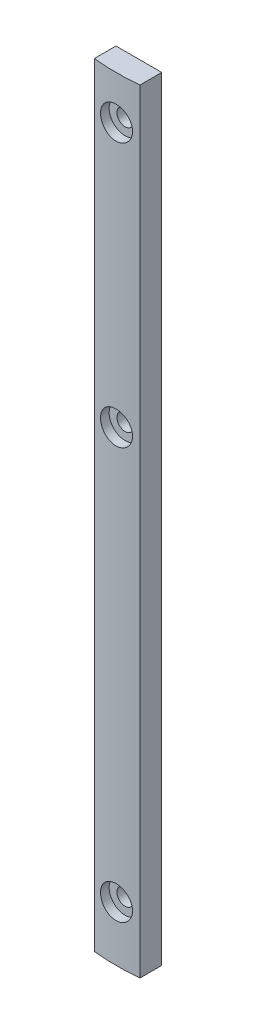
ISO-10303-21;
HEADER;
FILE_DESCRIPTION(('STEP AP214'),'2;1');
FILE_NAME('part.step','',(''),(''),'','','');
FILE_SCHEMA(('AUTOMOTIVE_DESIGN { 1 0 10303 214 1 1 1 1 }'));
ENDSEC;
DATA;
#1=APPLICATION_CONTEXT('core data for automotive mechanical design processes');
#2=APPLICATION_PROTOCOL_DEFINITION('international standard','automotive_design',2000,#1);
#3=PRODUCT_CONTEXT('',#1,'mechanical');
#4=PRODUCT('Part','Part','',(#3));
#5=PRODUCT_RELATED_PRODUCT_CATEGORY('part','',(#4));
#6=PRODUCT_DEFINITION_FORMATION('','',#4);
#7=PRODUCT_DEFINITION_CONTEXT('part definition',#1,'design');
#8=PRODUCT_DEFINITION('design','',#6,#7);
#9=PRODUCT_DEFINITION_SHAPE('','',#8);
#10=(LENGTH_UNIT() NAMED_UNIT(*) SI_UNIT(.MILLI.,.METRE.));
#11=(NAMED_UNIT(*) PLANE_ANGLE_UNIT() SI_UNIT($,.RADIAN.));
#12=(NAMED_UNIT(*) SI_UNIT($,.STERADIAN.) SOLID_ANGLE_UNIT());
#13=UNCERTAINTY_MEASURE_WITH_UNIT(LENGTH_MEASURE(1.E-05),#10,'distance_accuracy_value','');
#14=(GEOMETRIC_REPRESENTATION_CONTEXT(3) GLOBAL_UNCERTAINTY_ASSIGNED_CONTEXT((#13)) GLOBAL_UNIT_ASSIGNED_CONTEXT((#10,
#11,#12)) REPRESENTATION_CONTEXT('',''));
#15=CARTESIAN_POINT('',(0.,0.,0.));
#16=DIRECTION('',(0.,0.,1.));
#17=DIRECTION('',(1.,0.,0.));
#18=AXIS2_PLACEMENT_3D('',#15,#16,#17);
#19=CARTESIAN_POINT('',(1090.,0.,-47.2499999999911));
#20=DIRECTION('',(0.,1.,0.));
#21=DIRECTION('',(0.,0.,1.));
#22=AXIS2_PLACEMENT_3D('',#19,#20,#21);
#23=CYLINDRICAL_SURFACE('',#22,49.9999999999911);
#24=CARTESIAN_POINT('',(1093.5,12.,2.62734956871706));
#25=CARTESIAN_POINT('',(1093.49999138017,12.1963379671098,2.62735120449633));
#26=CARTESIAN_POINT('',(1093.48342363444,12.3928121645192,2.62852134189355));
#27=CARTESIAN_POINT('',(1093.41757146492,12.7803318097353,2.63307581308847));
#28=CARTESIAN_POINT('',(1093.36824929065,12.9713707279699,2.63646270169375));
#29=CARTESIAN_POINT('',(1093.23831511853,13.3423506761975,2.64506518164241));
#30=CARTESIAN_POINT('',(1093.15772003692,13.5222976452044,2.65027978418556));
#31=CARTESIAN_POINT('',(1092.9675561433,13.8660635685417,2.66194888415281));
#32=CARTESIAN_POINT('',(1092.85799382142,14.0298861242927,2.66840310375108));
#33=CARTESIAN_POINT('',(1092.61278459079,14.3371018148218,2.68183767441775));
#34=CARTESIAN_POINT('',(1092.47709528905,14.4804610789401,2.68881886919513));
#35=CARTESIAN_POINT('',(1092.18357227451,14.7423904278679,2.70251297643476));
#36=CARTESIAN_POINT('',(1092.02573762438,14.8609594628593,2.70922587752556));
#37=CARTESIAN_POINT('',(1091.69220885114,15.0700500669501,2.72163459083844));
#38=CARTESIAN_POINT('',(1091.51649680852,15.1605431187049,2.72732936645884));
#39=CARTESIAN_POINT('',(1091.1523265085,15.3107304887511,2.73705120037653));
#40=CARTESIAN_POINT('',(1090.96386841587,15.3704252050878,2.74107828022739));
#41=CARTESIAN_POINT('',(1090.57988621085,15.4572260571529,2.74700511883611));
#42=CARTESIAN_POINT('',(1090.38437430085,15.4843859295158,2.74890838506365));
#43=CARTESIAN_POINT('',(1089.99155802994,15.5055121300194,2.75038498685494));
#44=CARTESIAN_POINT('',(1089.79425369358,15.4994789119526,2.74995835427145));
#45=CARTESIAN_POINT('',(1089.40381741685,15.4544343871595,2.74682614467926));
#46=CARTESIAN_POINT('',(1089.21067877206,15.4154808766457,2.74412456169644));
#47=CARTESIAN_POINT('',(1088.83368812729,15.3057912630361,2.73675110550606));
#48=CARTESIAN_POINT('',(1088.64983619332,15.2350549340798,2.7320792182968));
#49=CARTESIAN_POINT('',(1088.29645283732,15.0637425182886,2.72128415384508));
#50=CARTESIAN_POINT('',(1088.12693410415,14.9631403400151,2.7151597085618));
#51=CARTESIAN_POINT('',(1087.80716770414,14.7349709167681,2.70214846131484));
#52=CARTESIAN_POINT('',(1087.65692031122,14.6074032885978,2.69526164851808));
#53=CARTESIAN_POINT('',(1087.37962403536,14.3285979422471,2.68148293330137));
#54=CARTESIAN_POINT('',(1087.25262560224,14.17731004088,2.67459105164825));
#55=CARTESIAN_POINT('',(1087.02582149579,13.8555341651356,2.6615939336943));
#56=CARTESIAN_POINT('',(1086.9260158365,13.6850461808486,2.65548869779949));
#57=CARTESIAN_POINT('',(1086.75643343827,13.3296764986289,2.64475455260411));
#58=CARTESIAN_POINT('',(1086.68665898547,13.1447937061507,2.64012575570496));
#59=CARTESIAN_POINT('',(1086.57915529323,12.7658979673136,2.63287030399696));
#60=CARTESIAN_POINT('',(1086.5414255802,12.571885155929,2.63024361959962));
#61=CARTESIAN_POINT('',(1086.49914555962,12.1806772089123,2.62729419034258));
#62=CARTESIAN_POINT('',(1086.49452505053,11.9834896955116,2.62696657079947));
#63=CARTESIAN_POINT('',(1086.51841102234,11.5911426069196,2.62863947589442));
#64=CARTESIAN_POINT('',(1086.54691728632,11.3959830184573,2.63063998528734));
#65=CARTESIAN_POINT('',(1086.63618923242,11.0134311453508,2.63673926921236));
#66=CARTESIAN_POINT('',(1086.69692244243,10.8260312465237,2.64083593149691));
#67=CARTESIAN_POINT('',(1086.8488913596,10.4640830507206,2.6506641101939));
#68=CARTESIAN_POINT('',(1086.94012741352,10.2895348998691,2.65639564519121));
#69=CARTESIAN_POINT('',(1087.15069098364,9.95792290936958,2.66885953942812));
#70=CARTESIAN_POINT('',(1087.27006545444,9.80088894800129,2.67559356452713));
#71=CARTESIAN_POINT('',(1087.53344908959,9.50906426056041,2.68929785850722));
#72=CARTESIAN_POINT('',(1087.67745855465,9.37427380604897,2.69626813027129));
#73=CARTESIAN_POINT('',(1087.98632682139,9.13052439152338,2.70967384841198));
#74=CARTESIAN_POINT('',(1088.15122156799,9.02161091964648,2.71610834025667));
#75=CARTESIAN_POINT('',(1088.49699943833,8.83301866210172,2.72770376230027));
#76=CARTESIAN_POINT('',(1088.67788244322,8.75333965910955,2.73286470196646));
#77=CARTESIAN_POINT('',(1089.05033638404,8.62555693316014,2.741327019617));
#78=CARTESIAN_POINT('',(1089.24189747753,8.57742463785627,2.7446300799261));
#79=CARTESIAN_POINT('',(1089.63040610456,8.5140081598169,2.7490112218645));
#80=CARTESIAN_POINT('',(1089.82735356908,8.49872355635988,2.75008933199153));
#81=CARTESIAN_POINT('',(1090.220594731,8.50144065025517,2.74989917364352));
#82=CARTESIAN_POINT('',(1090.41688892595,8.51937125983944,2.74863591620034));
#83=CARTESIAN_POINT('',(1090.8036717388,8.58786212118431,2.74391496467969));
#84=CARTESIAN_POINT('',(1090.99416034714,8.6384224266666,2.74045726698929));
#85=CARTESIAN_POINT('',(1091.36393324261,8.77072067745529,2.7317358399979));
#86=CARTESIAN_POINT('',(1091.54321776299,8.85245797347985,2.72647214830819));
#87=CARTESIAN_POINT('',(1091.88552933016,9.04478089968494,2.71472903213084));
#88=CARTESIAN_POINT('',(1092.04855674432,9.15536587778998,2.70824963512404));
#89=CARTESIAN_POINT('',(1092.35408850759,9.40251000111993,2.69478693063551));
#90=CARTESIAN_POINT('',(1092.49655077663,9.53912111262917,2.68780263263455));
#91=CARTESIAN_POINT('',(1092.75657317372,9.83435873053258,2.67412549210265));
#92=CARTESIAN_POINT('',(1092.87412722065,9.99299059749148,2.66743272106158));
#93=CARTESIAN_POINT('',(1093.08110643313,10.3279888458641,2.65508574173429));
#94=CARTESIAN_POINT('',(1093.17049072297,10.5043805127251,2.64943304755203));
#95=CARTESIAN_POINT('',(1093.31826310443,10.8695818033303,2.63982526197136));
#96=CARTESIAN_POINT('',(1093.37668728186,11.0583766805152,2.63586819525497));
#97=CARTESIAN_POINT('',(1093.44579537587,11.373594555691,2.631130447554));
#98=CARTESIAN_POINT('',(1093.46609558618,11.4979831481877,2.62971901286272));
#99=CARTESIAN_POINT('',(1093.49320065013,11.7482291527003,2.62782804975963));
#100=CARTESIAN_POINT('',(1093.50000552798,11.8740865620808,2.62734851967599));
#101=CARTESIAN_POINT('',(1093.5,12.,2.62734956871706));
#102=B_SPLINE_CURVE_WITH_KNOTS('',3,(#24,#25,#26,#27,#28,#29,#30,#31,#32,#33,#34,#35,#36,#37,
#38,#39,#40,#41,#42,#43,#44,#45,#46,#47,#48,#49,#50,#51,#52,#53,#54,#55,#56,#57,#58,#59,#60,#61,
#62,#63,#64,#65,#66,#67,#68,#69,#70,#71,#72,#73,#74,#75,#76,#77,#78,#79,#80,#81,#82,#83,#84,#85,
#86,#87,#88,#89,#90,#91,#92,#93,#94,#95,#96,#97,#98,#99,#100,#101),.UNSPECIFIED.,.T.,.F.,(4,2,2,
2,2,2,2,2,2,2,2,2,2,2,2,2,2,2,2,2,2,2,2,2,2,2,2,2,2,2,2,2,2,2,2,2,2,2,4),(0.,0.588554216273849,
1.17778793900945,1.7667033748431,2.35548697529844,2.94523409691633,3.53500618812309,
4.12537537631886,4.71573693424665,5.30512206277362,5.89449913366053,6.48284361445052,
7.07119227630166,7.66005645219794,8.24892899680198,8.83906461661263,9.42920054100748,
10.0193813817766,10.6095535003074,11.1984739038847,11.7873904510905,12.3757147252276,
12.9640456875756,13.5533654363641,14.1426923793651,14.7330477368472,15.3233987056342,
15.9132142427062,16.5030222252271,17.091569348774,17.68011744131,18.2686532776042,
18.8571758117363,19.4468860017004,20.0367399987804,20.6274460037432,21.2174619836193,
21.5949081740441,21.9723536873279),.UNSPECIFIED.);
#103=CARTESIAN_POINT('',(1093.5,12.,2.62734956871706));
#104=VERTEX_POINT('',#103);
#105=EDGE_CURVE('E11',#104,#104,#102,.T.);
#106=ORIENTED_EDGE('',*,*,#105,.F.);
#107=EDGE_LOOP('',(#106));
#108=FACE_BOUND('',#107,.T.);
#109=CARTESIAN_POINT('',(1090.,98.3249999999999,2.75000000000002));
#110=CARTESIAN_POINT('',(1090.19633863164,98.3250086192267,2.74999837907542));
#111=CARTESIAN_POINT('',(1090.39281349138,98.3415764733151,2.74883117932159));
#112=CARTESIAN_POINT('',(1090.78033451279,98.4074291124008,2.74428720396048));
#113=CARTESIAN_POINT('',(1090.97137414542,98.4567516455994,2.740907879049));
#114=CARTESIAN_POINT('',(1091.3423556039,98.5866868678232,2.73232181095957));
#115=CARTESIAN_POINT('',(1091.52230336271,98.6672826577107,2.727116054876));
#116=CARTESIAN_POINT('',(1091.86607060812,98.8574482190106,2.71546206784143));
#117=CARTESIAN_POINT('',(1092.02989369712,98.9670114985351,2.70901411536611));
#118=CARTESIAN_POINT('',(1092.33710878017,99.2122216943026,2.69558682754867));
#119=CARTESIAN_POINT('',(1092.48046707374,99.3479107898041,2.68860664409603));
#120=CARTESIAN_POINT('',(1092.74239455101,99.641432985065,2.67490879821906));
#121=CARTESIAN_POINT('',(1092.86096268193,99.7992670248039,2.66819114695383));
#122=CARTESIAN_POINT('',(1093.0700523448,100.132795268543,2.65576920751172));
#123=CARTESIAN_POINT('',(1093.16054519221,100.308507496968,2.65006595827173));
#124=CARTESIAN_POINT('',(1093.31073213311,100.672678200973,2.64032721574241));
#125=CARTESIAN_POINT('',(1093.37042662712,100.861136510766,2.63629170076592));
#126=CARTESIAN_POINT('',(1093.45722700842,101.245119359094,2.63035175169956));
#127=CARTESIAN_POINT('',(1093.48438661502,101.440631699018,2.62844380508081));
#128=CARTESIAN_POINT('',(1093.50551213506,101.833448810105,2.62696364499766));
#129=CARTESIAN_POINT('',(1093.49947850512,102.030753556575,2.62739139940227));
#130=CARTESIAN_POINT('',(1093.45443333279,102.421188004692,2.63053114409502));
#131=CARTESIAN_POINT('',(1093.41548000108,102.614324459157,2.63323910235291));
#132=CARTESIAN_POINT('',(1093.30579150607,102.991310815435,2.64062776358891));
#133=CARTESIAN_POINT('',(1093.23505611292,103.175160650073,2.64530848083498));
#134=CARTESIAN_POINT('',(1093.06374562537,103.528541478924,2.65611984863481));
#135=CARTESIAN_POINT('',(1092.96314421964,103.698059677372,2.66225177670483));
#136=CARTESIAN_POINT('',(1092.73497644022,104.017825336465,2.67527333775609));
#137=CARTESIAN_POINT('',(1092.60740968378,104.168072523531,2.68216298149164));
#138=CARTESIAN_POINT('',(1092.32860495015,104.445369801028,2.6959415230635));
#139=CARTESIAN_POINT('',(1092.17731661324,104.572369265152,2.70283038737479));
#140=CARTESIAN_POINT('',(1091.85553950076,104.799175243437,2.71581687919972));
#141=CARTESIAN_POINT('',(1091.68505071677,104.898981745654,2.7219145063658));
#142=CARTESIAN_POINT('',(1091.32968082988,105.068564748178,2.73263213207805));
#143=CARTESIAN_POINT('',(1091.14479875806,105.138339224735,2.73725203104001));
#144=CARTESIAN_POINT('',(1090.76590458386,105.245843185864,2.74449236634767));
#145=CARTESIAN_POINT('',(1090.57189261523,105.283573139714,2.74711283197416));
#146=CARTESIAN_POINT('',(1090.18068504118,105.3258540668,2.750055263323));
#147=CARTESIAN_POINT('',(1089.98349703321,105.33047501352,2.75038207648346));
#148=CARTESIAN_POINT('',(1089.59114884991,105.306589740385,2.74871328880188));
#149=CARTESIAN_POINT('',(1089.39598866132,105.278083737478,2.74671770316911));
#150=CARTESIAN_POINT('',(1089.01343389964,105.188811703042,2.7406318136717));
#151=CARTESIAN_POINT('',(1088.82603177355,105.128077883511,2.73654360155033));
#152=CARTESIAN_POINT('',(1088.46407939342,104.976107000166,2.72673216771377));
#153=CARTESIAN_POINT('',(1088.28952928399,104.884869593175,2.72100892760388));
#154=CARTESIAN_POINT('',(1087.95791598843,104.674304048192,2.70855793441761));
#155=CARTESIAN_POINT('',(1087.80088246197,104.55492929973,2.70182852141871));
#156=CARTESIAN_POINT('',(1087.50905878161,104.291545357322,2.6881276748206));
#157=CARTESIAN_POINT('',(1087.37426890115,104.147535860594,2.68115623824755));
#158=CARTESIAN_POINT('',(1087.13052068519,103.838667850488,2.66774291799081));
#159=CARTESIAN_POINT('',(1087.02160783291,103.673773396614,2.66130197953635));
#160=CARTESIAN_POINT('',(1086.83301666333,103.327996272954,2.64969120238774));
#161=CARTESIAN_POINT('',(1086.7533381288,103.147113721989,2.64452135424814));
#162=CARTESIAN_POINT('',(1086.62555572199,102.774659460608,2.63604265153162));
#163=CARTESIAN_POINT('',(1086.57742348016,102.583097522879,2.63273212525153));
#164=CARTESIAN_POINT('',(1086.51400739526,102.194587118728,2.62834080761243));
#165=CARTESIAN_POINT('',(1086.49872312701,101.997638722065,2.62725998739076));
#166=CARTESIAN_POINT('',(1086.50144118092,101.604398169032,2.62745067978259));
#167=CARTESIAN_POINT('',(1086.51937201449,101.4081055121,2.62871714036491));
#168=CARTESIAN_POINT('',(1086.58786278192,101.021325830167,2.6334489743632));
#169=CARTESIAN_POINT('',(1086.63842277224,100.830838815212,2.63691435158448));
#170=CARTESIAN_POINT('',(1086.77071981125,100.461069050189,2.64565225459453));
#171=CARTESIAN_POINT('',(1086.85245620529,100.281786064953,2.65092474243774));
#172=CARTESIAN_POINT('',(1087.04477685373,99.939477190394,2.66268272532582));
#173=CARTESIAN_POINT('',(1087.15536045773,99.7764509346556,2.66916819302146));
#174=CARTESIAN_POINT('',(1087.40250308958,99.4709190563869,2.68263775318362));
#175=CARTESIAN_POINT('',(1087.53911439659,99.328455766485,2.68962283122004));
#176=CARTESIAN_POINT('',(1087.83435282273,99.0684314012314,2.70329580872772));
#177=CARTESIAN_POINT('',(1087.9929853002,98.9508764043595,2.70998363534549));
#178=CARTESIAN_POINT('',(1088.32798402583,98.7438961922312,2.72231711522721));
#179=CARTESIAN_POINT('',(1088.50437545036,98.6545116760068,2.72796125581812));
#180=CARTESIAN_POINT('',(1088.869576223,98.5067388037686,2.73755215013602));
#181=CARTESIAN_POINT('',(1089.05837082598,98.4483143653199,2.74150087875806));
#182=CARTESIAN_POINT('',(1089.37358940198,98.3792055209418,2.74622811536111));
#183=CARTESIAN_POINT('',(1089.49797902258,98.3589049732448,2.74763623612632));
#184=CARTESIAN_POINT('',(1089.74822708781,98.3317994609679,2.74952269737857));
#185=CARTESIAN_POINT('',(1089.87408552982,98.3249944723798,2.75000103951966));
#186=CARTESIAN_POINT('',(1090.,98.3249999999999,2.75000000000002));
#187=B_SPLINE_CURVE_WITH_KNOTS('',3,(#109,#110,#111,#112,#113,#114,#115,#116,#117,#118,#119,
#120,#121,#122,#123,#124,#125,#126,#127,#128,#129,#130,#131,#132,#133,#134,#135,#136,#137,#138,
#139,#140,#141,#142,#143,#144,#145,#146,#147,#148,#149,#150,#151,#152,#153,#154,#155,#156,#157,
#158,#159,#160,#161,#162,#163,#164,#165,#166,#167,#168,#169,#170,#171,#172,#173,#174,#175,#176,
#177,#178,#179,#180,#181,#182,#183,#184,#185,#186),.UNSPECIFIED.,.T.,.F.,(4,2,2,2,2,2,2,2,2,2,2,
2,2,2,2,2,2,2,2,2,2,2,2,2,2,2,2,2,2,2,2,2,2,2,2,2,2,2,4),(0.,0.588556212147826,1.17779188700161,
1.76670959884712,2.35549544038453,2.94523995074923,3.53500950139001,4.12537965082144,
4.71574212285471,5.30512848072045,5.89450673073314,6.48284498047499,7.07118748544073,
7.66004985378245,8.24892058096688,8.8390588134622,9.42919730518082,10.0193755580006,
10.6095451677648,11.1984671279751,11.7873852313904,12.3757158114863,12.9640530107862,
13.5533717465254,14.1426977259912,14.7330520061157,15.3234018991908,15.9132201596494,
16.5030307851019,17.0915734403964,17.6801171141911,18.2686484305503,18.8571664788072,
19.4468793278339,20.0367359217423,20.6274408396781,21.2174557977684,21.5949050793505,
21.9723536894577),.UNSPECIFIED.);
#188=CARTESIAN_POINT('',(1090.,98.3249999999999,2.75000000000002));
#189=VERTEX_POINT('',#188);
#190=EDGE_CURVE('E117',#189,#189,#187,.T.);
#191=ORIENTED_EDGE('',*,*,#190,.F.);
#192=EDGE_LOOP('',(#191));
#193=FACE_BOUND('',#192,.T.);
#194=CARTESIAN_POINT('',(1090.,169.,-47.2499999999911));
#195=DIRECTION('',(0.,1.,0.));
#196=DIRECTION('',(0.,0.,1.));
#197=AXIS2_PLACEMENT_3D('',#194,#195,#196);
#198=CIRCLE('',#197,49.9999999999911);
#199=CARTESIAN_POINT('',(1085.,169.,2.49937185533099));
#200=VERTEX_POINT('',#199);
#201=CARTESIAN_POINT('',(1095.,169.,2.49937185533097));
#202=VERTEX_POINT('',#201);
#203=EDGE_CURVE('E107',#200,#202,#198,.T.);
#204=ORIENTED_EDGE('',*,*,#203,.F.);
#205=DIRECTION('',(0.,1.,0.));
#206=VECTOR('',#205,1.);
#207=CARTESIAN_POINT('',(1085.,0.,2.49937185533099));
#208=LINE('',#207,#206);
#209=CARTESIAN_POINT('',(1085.,0.,2.49937185533099));
#210=VERTEX_POINT('',#209);
#211=EDGE_CURVE('E55',#210,#200,#208,.T.);
#212=ORIENTED_EDGE('',*,*,#211,.F.);
#213=CARTESIAN_POINT('',(1090.,0.,-47.2499999999911));
#214=DIRECTION('',(0.,1.,0.));
#215=DIRECTION('',(0.,0.,1.));
#216=AXIS2_PLACEMENT_3D('',#213,#214,#215);
#217=CIRCLE('',#216,49.9999999999911);
#218=CARTESIAN_POINT('',(1095.,0.,2.49937185533097));
#219=VERTEX_POINT('',#218);
#220=EDGE_CURVE('E100',#210,#219,#217,.T.);
#221=ORIENTED_EDGE('',*,*,#220,.T.);
#222=DIRECTION('',(0.,1.,0.));
#223=VECTOR('',#222,1.);
#224=CARTESIAN_POINT('',(1095.,0.,2.49937185533097));
#225=LINE('',#224,#223);
#226=EDGE_CURVE('E83',#219,#202,#225,.T.);
#227=ORIENTED_EDGE('',*,*,#226,.T.);
#228=EDGE_LOOP('',(#204,#212,#221,#227));
#229=FACE_BOUND('',#228,.T.);
#230=CARTESIAN_POINT('',(1090.,163.,2.75));
#231=CARTESIAN_POINT('',(1090.19633863164,162.999991380773,2.74999837907539));
#232=CARTESIAN_POINT('',(1090.39281349138,162.983423526685,2.74883117932159));
#233=CARTESIAN_POINT('',(1090.78033451279,162.917570887599,2.7442872039605));
#234=CARTESIAN_POINT('',(1090.97137414542,162.868248354401,2.74090787904901));
#235=CARTESIAN_POINT('',(1091.3423556039,162.738313132177,2.73232181095957));
#236=CARTESIAN_POINT('',(1091.52230336271,162.657717342289,2.727116054876));
#237=CARTESIAN_POINT('',(1091.86607060812,162.467551780989,2.71546206784143));
#238=CARTESIAN_POINT('',(1092.02989369712,162.357988501465,2.7090141153661));
#239=CARTESIAN_POINT('',(1092.33710878017,162.112778305697,2.69558682754867));
#240=CARTESIAN_POINT('',(1092.48046707374,161.977089210196,2.68860664409603));
#241=CARTESIAN_POINT('',(1092.74239455101,161.683567014935,2.67490879821905));
#242=CARTESIAN_POINT('',(1092.86096268193,161.525732975196,2.66819114695382));
#243=CARTESIAN_POINT('',(1093.0700523448,161.192204731457,2.65576920751172));
#244=CARTESIAN_POINT('',(1093.16054519221,161.016492503031,2.65006595827173));
#245=CARTESIAN_POINT('',(1093.31073213311,160.652321799026,2.64032721574242));
#246=CARTESIAN_POINT('',(1093.37042662712,160.463863489234,2.63629170076592));
#247=CARTESIAN_POINT('',(1093.45722700842,160.079880640905,2.63035175169956));
#248=CARTESIAN_POINT('',(1093.48438661502,159.884368300982,2.62844380508081));
#249=CARTESIAN_POINT('',(1093.50551213506,159.491551189894,2.62696364499766));
#250=CARTESIAN_POINT('',(1093.49947850512,159.294246443425,2.62739139940228));
#251=CARTESIAN_POINT('',(1093.45443333279,158.903811995307,2.63053114409503));
#252=CARTESIAN_POINT('',(1093.41548000108,158.710675540843,2.63323910235291));
#253=CARTESIAN_POINT('',(1093.30579150607,158.333689184565,2.64062776358891));
#254=CARTESIAN_POINT('',(1093.23505611292,158.149839349927,2.64530848083499));
#255=CARTESIAN_POINT('',(1093.06374562537,157.796458521076,2.65611984863482));
#256=CARTESIAN_POINT('',(1092.96314421964,157.626940322628,2.66225177670484));
#257=CARTESIAN_POINT('',(1092.73497644022,157.307174663534,2.6752733377561));
#258=CARTESIAN_POINT('',(1092.60740968378,157.156927476469,2.68216298149165));
#259=CARTESIAN_POINT('',(1092.32860495015,156.879630198972,2.69594152306352));
#260=CARTESIAN_POINT('',(1092.17731661324,156.752630734848,2.7028303873748));
#261=CARTESIAN_POINT('',(1091.85553950076,156.525824756563,2.71581687919973));
#262=CARTESIAN_POINT('',(1091.68505071677,156.426018254346,2.72191450636581));
#263=CARTESIAN_POINT('',(1091.32968082988,156.256435251822,2.73263213207806));
#264=CARTESIAN_POINT('',(1091.14479875806,156.186660775265,2.73725203104002));
#265=CARTESIAN_POINT('',(1090.76590458386,156.079156814136,2.74449236634768));
#266=CARTESIAN_POINT('',(1090.57189261523,156.041426860286,2.74711283197416));
#267=CARTESIAN_POINT('',(1090.18068504118,155.9991459332,2.750055263323));
#268=CARTESIAN_POINT('',(1089.98349703321,155.99452498648,2.75038207648346));
#269=CARTESIAN_POINT('',(1089.59114884991,156.018410259615,2.74871328880189));
#270=CARTESIAN_POINT('',(1089.39598866132,156.046916262523,2.74671770316912));
#271=CARTESIAN_POINT('',(1089.01343389963,156.136188296958,2.7406318136717));
#272=CARTESIAN_POINT('',(1088.82603177355,156.19692211649,2.73654360155033));
#273=CARTESIAN_POINT('',(1088.46407939342,156.348892999834,2.72673216771376));
#274=CARTESIAN_POINT('',(1088.28952928399,156.440130406825,2.72100892760388));
#275=CARTESIAN_POINT('',(1087.95791598843,156.650695951808,2.70855793441761));
#276=CARTESIAN_POINT('',(1087.80088246197,156.77007070027,2.70182852141871));
#277=CARTESIAN_POINT('',(1087.50905878161,157.033454642678,2.6881276748206));
#278=CARTESIAN_POINT('',(1087.37426890115,157.177464139406,2.68115623824755));
#279=CARTESIAN_POINT('',(1087.13052068519,157.486332149512,2.66774291799081));
#280=CARTESIAN_POINT('',(1087.02160783291,157.651226603386,2.66130197953634));
#281=CARTESIAN_POINT('',(1086.83301666333,157.997003727047,2.64969120238773));
#282=CARTESIAN_POINT('',(1086.7533381288,158.177886278012,2.64452135424814));
#283=CARTESIAN_POINT('',(1086.62555572199,158.550340539392,2.63604265153162));
#284=CARTESIAN_POINT('',(1086.57742348016,158.741902477121,2.63273212525154));
#285=CARTESIAN_POINT('',(1086.51400739526,159.130412881272,2.62834080761243));
#286=CARTESIAN_POINT('',(1086.49872312701,159.327361277935,2.62725998739076));
#287=CARTESIAN_POINT('',(1086.50144118092,159.720601830968,2.62745067978259));
#288=CARTESIAN_POINT('',(1086.51937201449,159.9168944879,2.62871714036492));
#289=CARTESIAN_POINT('',(1086.58786278192,160.303674169834,2.63344897436321));
#290=CARTESIAN_POINT('',(1086.63842277224,160.494161184788,2.63691435158449));
#291=CARTESIAN_POINT('',(1086.77071981125,160.863930949811,2.64565225459454));
#292=CARTESIAN_POINT('',(1086.85245620529,161.043213935047,2.65092474243775));
#293=CARTESIAN_POINT('',(1087.04477685373,161.385522809606,2.66268272532583));
#294=CARTESIAN_POINT('',(1087.15536045773,161.548549065344,2.66916819302147));
#295=CARTESIAN_POINT('',(1087.40250308958,161.854080943613,2.68263775318363));
#296=CARTESIAN_POINT('',(1087.53911439659,161.996544233515,2.68962283122005));
#297=CARTESIAN_POINT('',(1087.83435282273,162.256568598769,2.70329580872773));
#298=CARTESIAN_POINT('',(1087.9929853002,162.374123595641,2.7099836353455));
#299=CARTESIAN_POINT('',(1088.32798402583,162.581103807769,2.72231711522721));
#300=CARTESIAN_POINT('',(1088.50437545036,162.670488323993,2.72796125581812));
#301=CARTESIAN_POINT('',(1088.869576223,162.818261196231,2.73755215013602));
#302=CARTESIAN_POINT('',(1089.05837082598,162.87668563468,2.74150087875806));
#303=CARTESIAN_POINT('',(1089.37358940198,162.945794479058,2.74622811536111));
#304=CARTESIAN_POINT('',(1089.49797902258,162.966095026755,2.74763623612632));
#305=CARTESIAN_POINT('',(1089.74822708781,162.993200539032,2.74952269737856));
#306=CARTESIAN_POINT('',(1089.87408552982,163.00000552762,2.75000103951963));
#307=CARTESIAN_POINT('',(1090.,163.,2.75));
#308=B_SPLINE_CURVE_WITH_KNOTS('',3,(#230,#231,#232,#233,#234,#235,#236,#237,#238,#239,#240,
#241,#242,#243,#244,#245,#246,#247,#248,#249,#250,#251,#252,#253,#254,#255,#256,#257,#258,#259,
#260,#261,#262,#263,#264,#265,#266,#267,#268,#269,#270,#271,#272,#273,#274,#275,#276,#277,#278,
#279,#280,#281,#282,#283,#284,#285,#286,#287,#288,#289,#290,#291,#292,#293,#294,#295,#296,#297,
#298,#299,#300,#301,#302,#303,#304,#305,#306,#307),.UNSPECIFIED.,.T.,.F.,(4,2,2,2,2,2,2,2,2,2,2,
2,2,2,2,2,2,2,2,2,2,2,2,2,2,2,2,2,2,2,2,2,2,2,2,2,2,2,4),(0.,0.588556212147827,1.1777918870016,
1.76670959884712,2.35549544038454,2.94523995074975,3.53500950139039,4.12537965082163,
4.71574212285484,5.30512848072063,5.89450673073328,6.48284498047511,7.07118748544085,
7.66004985378259,8.24892058096684,8.83905881346209,9.42919730518117,10.0193755580009,
10.6095451677649,11.1984671279749,11.7873852313905,12.3757158114864,12.9640530107861,
13.5533717465253,14.1426977259911,14.7330520061157,15.3234018991907,15.9132201596493,
16.5030307851018,17.0915734403963,17.680117114191,18.2686484305502,18.8571664788071,
19.4468793278338,20.0367359217422,20.6274408396777,21.217455797768,21.5949050793501,
21.9723536894573),.UNSPECIFIED.);
#309=CARTESIAN_POINT('',(1090.,163.,2.75));
#310=VERTEX_POINT('',#309);
#311=EDGE_CURVE('E47',#310,#310,#308,.T.);
#312=ORIENTED_EDGE('',*,*,#311,.T.);
#313=EDGE_LOOP('',(#312));
#314=FACE_BOUND('',#313,.T.);
#315=ADVANCED_FACE('F35',(#108,#193,#229,#314),#23,.T.);
#316=CARTESIAN_POINT('',(1085.,0.,-2.2500000000001));
#317=DIRECTION('',(-1.,0.,0.));
#318=DIRECTION('',(0.,0.,1.));
#319=AXIS2_PLACEMENT_3D('',#316,#317,#318);
#320=PLANE('',#319);
#321=DIRECTION('',(0.,0.,1.));
#322=VECTOR('',#321,1.);
#323=CARTESIAN_POINT('',(1085.,169.,-2.2500000000001));
#324=LINE('',#323,#322);
#325=CARTESIAN_POINT('',(1085.,169.,-2.2500000000001));
#326=VERTEX_POINT('',#325);
#327=EDGE_CURVE('E102',#326,#200,#324,.T.);
#328=ORIENTED_EDGE('',*,*,#327,.F.);
#329=DIRECTION('',(0.,1.,0.));
#330=VECTOR('',#329,1.);
#331=CARTESIAN_POINT('',(1085.,0.,-2.2500000000001));
#332=LINE('',#331,#330);
#333=CARTESIAN_POINT('',(1085.,0.,-2.2500000000001));
#334=VERTEX_POINT('',#333);
#335=EDGE_CURVE('E72',#334,#326,#332,.T.);
#336=ORIENTED_EDGE('',*,*,#335,.F.);
#337=DIRECTION('',(0.,0.,1.));
#338=VECTOR('',#337,1.);
#339=CARTESIAN_POINT('',(1085.,0.,-2.2500000000001));
#340=LINE('',#339,#338);
#341=EDGE_CURVE('E97',#334,#210,#340,.T.);
#342=ORIENTED_EDGE('',*,*,#341,.T.);
#343=ORIENTED_EDGE('',*,*,#211,.T.);
#344=EDGE_LOOP('',(#328,#336,#342,#343));
#345=FACE_BOUND('',#344,.T.);
#346=ADVANCED_FACE('F149',(#345),#320,.T.);
#347=CARTESIAN_POINT('',(1095.,0.,-2.2500000000001));
#348=DIRECTION('',(0.,0.,-1.));
#349=DIRECTION('',(-1.,0.,0.));
#350=AXIS2_PLACEMENT_3D('',#347,#348,#349);
#351=PLANE('',#350);
#352=CARTESIAN_POINT('',(1090.,12.,-2.25));
#353=DIRECTION('',(0.,0.,1.));
#354=DIRECTION('',(1.,0.,0.));
#355=AXIS2_PLACEMENT_3D('',#352,#353,#354);
#356=CIRCLE('',#355,1.8);
#357=CARTESIAN_POINT('',(1091.8,12.,-2.25));
#358=VERTEX_POINT('',#357);
#359=EDGE_CURVE('E202',#358,#358,#356,.T.);
#360=ORIENTED_EDGE('',*,*,#359,.T.);
#361=EDGE_LOOP('',(#360));
#362=FACE_BOUND('',#361,.T.);
#363=CARTESIAN_POINT('',(1090.,159.5,-2.25));
#364=DIRECTION('',(0.,0.,-1.));
#365=DIRECTION('',(-1.,0.,0.));
#366=AXIS2_PLACEMENT_3D('',#363,#364,#365);
#367=CIRCLE('',#366,1.8);
#368=CARTESIAN_POINT('',(1088.2,159.5,-2.25));
#369=VERTEX_POINT('',#368);
#370=EDGE_CURVE('E187',#369,#369,#367,.T.);
#371=ORIENTED_EDGE('',*,*,#370,.F.);
#372=EDGE_LOOP('',(#371));
#373=FACE_BOUND('',#372,.T.);
#374=CARTESIAN_POINT('',(1090.,101.825,-2.25000000000016));
#375=DIRECTION('',(0.,0.,1.));
#376=DIRECTION('',(0.,-1.,0.));
#377=AXIS2_PLACEMENT_3D('',#374,#375,#376);
#378=CIRCLE('',#377,1.80000000000002);
#379=CARTESIAN_POINT('',(1090.,100.025,-2.25000000000016));
#380=VERTEX_POINT('',#379);
#381=EDGE_CURVE('E111',#380,#380,#378,.T.);
#382=ORIENTED_EDGE('',*,*,#381,.T.);
#383=EDGE_LOOP('',(#382));
#384=FACE_BOUND('',#383,.T.);
#385=DIRECTION('',(-1.,0.,0.));
#386=VECTOR('',#385,1.);
#387=CARTESIAN_POINT('',(1095.,169.,-2.2500000000001));
#388=LINE('',#387,#386);
#389=CARTESIAN_POINT('',(1095.,169.,-2.2500000000001));
#390=VERTEX_POINT('',#389);
#391=EDGE_CURVE('E91',#390,#326,#388,.T.);
#392=ORIENTED_EDGE('',*,*,#391,.F.);
#393=DIRECTION('',(0.,1.,0.));
#394=VECTOR('',#393,1.);
#395=CARTESIAN_POINT('',(1095.,0.,-2.2500000000001));
#396=LINE('',#395,#394);
#397=CARTESIAN_POINT('',(1095.,0.,-2.2500000000001));
#398=VERTEX_POINT('',#397);
#399=EDGE_CURVE('E86',#398,#390,#396,.T.);
#400=ORIENTED_EDGE('',*,*,#399,.F.);
#401=DIRECTION('',(-1.,0.,0.));
#402=VECTOR('',#401,1.);
#403=CARTESIAN_POINT('',(1095.,0.,-2.2500000000001));
#404=LINE('',#403,#402);
#405=EDGE_CURVE('E89',#398,#334,#404,.T.);
#406=ORIENTED_EDGE('',*,*,#405,.T.);
#407=ORIENTED_EDGE('',*,*,#335,.T.);
#408=EDGE_LOOP('',(#392,#400,#406,#407));
#409=FACE_BOUND('',#408,.T.);
#410=ADVANCED_FACE('F88',(#362,#373,#384,#409),#351,.T.);
#411=CARTESIAN_POINT('',(1095.,0.,2.49937185533097));
#412=DIRECTION('',(1.,0.,0.));
#413=DIRECTION('',(0.,0.,-1.));
#414=AXIS2_PLACEMENT_3D('',#411,#412,#413);
#415=PLANE('',#414);
#416=DIRECTION('',(0.,0.,-1.));
#417=VECTOR('',#416,1.);
#418=CARTESIAN_POINT('',(1095.,169.,2.49937185533097));
#419=LINE('',#418,#417);
#420=EDGE_CURVE('E110',#202,#390,#419,.T.);
#421=ORIENTED_EDGE('',*,*,#420,.F.);
#422=ORIENTED_EDGE('',*,*,#226,.F.);
#423=DIRECTION('',(0.,0.,-1.));
#424=VECTOR('',#423,1.);
#425=CARTESIAN_POINT('',(1095.,0.,2.49937185533097));
#426=LINE('',#425,#424);
#427=EDGE_CURVE('E96',#219,#398,#426,.T.);
#428=ORIENTED_EDGE('',*,*,#427,.T.);
#429=ORIENTED_EDGE('',*,*,#399,.T.);
#430=EDGE_LOOP('',(#421,#422,#428,#429));
#431=FACE_BOUND('',#430,.T.);
#432=ADVANCED_FACE('F99',(#431),#415,.T.);
#433=CARTESIAN_POINT('',(1090.,0.,-47.2499999999911));
#434=DIRECTION('',(0.,1.,0.));
#435=DIRECTION('',(0.,0.,1.));
#436=AXIS2_PLACEMENT_3D('',#433,#434,#435);
#437=PLANE('',#436);
#438=ORIENTED_EDGE('',*,*,#220,.F.);
#439=ORIENTED_EDGE('',*,*,#341,.F.);
#440=ORIENTED_EDGE('',*,*,#405,.F.);
#441=ORIENTED_EDGE('',*,*,#427,.F.);
#442=EDGE_LOOP('',(#438,#439,#440,#441));
#443=FACE_BOUND('',#442,.T.);
#444=ADVANCED_FACE('F95',(#443),#437,.F.);
#445=CARTESIAN_POINT('',(1090.,169.,-47.2499999999911));
#446=DIRECTION('',(0.,1.,0.));
#447=DIRECTION('',(0.,0.,1.));
#448=AXIS2_PLACEMENT_3D('',#445,#446,#447);
#449=PLANE('',#448);
#450=ORIENTED_EDGE('',*,*,#203,.T.);
#451=ORIENTED_EDGE('',*,*,#420,.T.);
#452=ORIENTED_EDGE('',*,*,#391,.T.);
#453=ORIENTED_EDGE('',*,*,#327,.T.);
#454=EDGE_LOOP('',(#450,#451,#452,#453));
#455=FACE_BOUND('',#454,.T.);
#456=ADVANCED_FACE('F142',(#455),#449,.T.);
#457=CARTESIAN_POINT('',(1090.,101.825,2.75000000000002));
#458=DIRECTION('',(0.,0.,1.));
#459=DIRECTION('',(0.,-1.,0.));
#460=AXIS2_PLACEMENT_3D('',#457,#458,#459);
#461=CYLINDRICAL_SURFACE('',#460,1.80000000000002);
#462=ORIENTED_EDGE('',*,*,#381,.F.);
#463=EDGE_LOOP('',(#462));
#464=FACE_BOUND('',#463,.T.);
#465=CARTESIAN_POINT('',(1090.,101.825,0.749999999999917));
#466=DIRECTION('',(0.,0.,1.));
#467=DIRECTION('',(0.,-1.,0.));
#468=AXIS2_PLACEMENT_3D('',#465,#466,#467);
#469=CIRCLE('',#468,1.80000000000002);
#470=CARTESIAN_POINT('',(1090.,100.025,0.749999999999918));
#471=VERTEX_POINT('',#470);
#472=EDGE_CURVE('E184',#471,#471,#469,.T.);
#473=ORIENTED_EDGE('',*,*,#472,.T.);
#474=EDGE_LOOP('',(#473));
#475=FACE_BOUND('',#474,.T.);
#476=ADVANCED_FACE('F138',(#464,#475),#461,.F.);
#477=CARTESIAN_POINT('',(1091.8,101.825,0.749999999999917));
#478=DIRECTION('',(0.,0.,-1.));
#479=DIRECTION('',(0.,1.,0.));
#480=AXIS2_PLACEMENT_3D('',#477,#478,#479);
#481=PLANE('',#480);
#482=ORIENTED_EDGE('',*,*,#472,.F.);
#483=EDGE_LOOP('',(#482));
#484=FACE_BOUND('',#483,.T.);
#485=CARTESIAN_POINT('',(1090.,101.825,0.749999999999917));
#486=DIRECTION('',(0.,0.,1.));
#487=DIRECTION('',(0.,-1.,0.));
#488=AXIS2_PLACEMENT_3D('',#485,#486,#487);
#489=CIRCLE('',#488,3.50000000000006);
#490=CARTESIAN_POINT('',(1090.,98.3249999999999,0.749999999999919));
#491=VERTEX_POINT('',#490);
#492=EDGE_CURVE('E180',#491,#491,#489,.T.);
#493=ORIENTED_EDGE('',*,*,#492,.T.);
#494=EDGE_LOOP('',(#493));
#495=FACE_BOUND('',#494,.T.);
#496=ADVANCED_FACE('F132',(#484,#495),#481,.F.);
#497=CARTESIAN_POINT('',(1090.,101.825,2.75000000000002));
#498=DIRECTION('',(0.,0.,1.));
#499=DIRECTION('',(0.,-1.,0.));
#500=AXIS2_PLACEMENT_3D('',#497,#498,#499);
#501=CYLINDRICAL_SURFACE('',#500,3.50000000000006);
#502=ORIENTED_EDGE('',*,*,#190,.T.);
#503=EDGE_LOOP('',(#502));
#504=FACE_BOUND('',#503,.T.);
#505=ORIENTED_EDGE('',*,*,#492,.F.);
#506=EDGE_LOOP('',(#505));
#507=FACE_BOUND('',#506,.T.);
#508=ADVANCED_FACE('F127',(#504,#507),#501,.F.);
#509=CARTESIAN_POINT('',(1090.,159.5,-2.25));
#510=DIRECTION('',(0.,0.,-1.));
#511=DIRECTION('',(-1.,0.,0.));
#512=AXIS2_PLACEMENT_3D('',#509,#510,#511);
#513=CYLINDRICAL_SURFACE('',#512,3.5);
#514=CARTESIAN_POINT('',(1090.,159.5,0.749999999999998));
#515=DIRECTION('',(0.,0.,-1.));
#516=DIRECTION('',(-1.,0.,0.));
#517=AXIS2_PLACEMENT_3D('',#514,#515,#516);
#518=CIRCLE('',#517,3.5);
#519=CARTESIAN_POINT('',(1086.5,159.5,0.749999999999998));
#520=VERTEX_POINT('',#519);
#521=EDGE_CURVE('E178',#520,#520,#518,.T.);
#522=ORIENTED_EDGE('',*,*,#521,.T.);
#523=EDGE_LOOP('',(#522));
#524=FACE_BOUND('',#523,.T.);
#525=ORIENTED_EDGE('',*,*,#311,.F.);
#526=EDGE_LOOP('',(#525));
#527=FACE_BOUND('',#526,.T.);
#528=ADVANCED_FACE('F131',(#524,#527),#513,.F.);
#529=CARTESIAN_POINT('',(1090.,156.,0.749999999999998));
#530=DIRECTION('',(0.,0.,1.));
#531=DIRECTION('',(1.,0.,0.));
#532=AXIS2_PLACEMENT_3D('',#529,#530,#531);
#533=PLANE('',#532);
#534=CARTESIAN_POINT('',(1090.,159.5,0.749999999999998));
#535=DIRECTION('',(0.,0.,-1.));
#536=DIRECTION('',(-1.,0.,0.));
#537=AXIS2_PLACEMENT_3D('',#534,#535,#536);
#538=CIRCLE('',#537,1.8);
#539=CARTESIAN_POINT('',(1088.2,159.5,0.749999999999998));
#540=VERTEX_POINT('',#539);
#541=EDGE_CURVE('E181',#540,#540,#538,.T.);
#542=ORIENTED_EDGE('',*,*,#541,.T.);
#543=EDGE_LOOP('',(#542));
#544=FACE_BOUND('',#543,.T.);
#545=ORIENTED_EDGE('',*,*,#521,.F.);
#546=EDGE_LOOP('',(#545));
#547=FACE_BOUND('',#546,.T.);
#548=ADVANCED_FACE('F169',(#544,#547),#533,.T.);
#549=CARTESIAN_POINT('',(1090.,159.5,-2.25));
#550=DIRECTION('',(0.,0.,-1.));
#551=DIRECTION('',(-1.,0.,0.));
#552=AXIS2_PLACEMENT_3D('',#549,#550,#551);
#553=CYLINDRICAL_SURFACE('',#552,1.8);
#554=ORIENTED_EDGE('',*,*,#370,.T.);
#555=EDGE_LOOP('',(#554));
#556=FACE_BOUND('',#555,.T.);
#557=ORIENTED_EDGE('',*,*,#541,.F.);
#558=EDGE_LOOP('',(#557));
#559=FACE_BOUND('',#558,.T.);
#560=ADVANCED_FACE('F174',(#556,#559),#553,.F.);
#561=CARTESIAN_POINT('',(1090.,12.,2.75));
#562=DIRECTION('',(0.,0.,1.));
#563=DIRECTION('',(1.,0.,0.));
#564=AXIS2_PLACEMENT_3D('',#561,#562,#563);
#565=CYLINDRICAL_SURFACE('',#564,1.8);
#566=ORIENTED_EDGE('',*,*,#359,.F.);
#567=EDGE_LOOP('',(#566));
#568=FACE_BOUND('',#567,.T.);
#569=CARTESIAN_POINT('',(1090.,12.,0.749999999999998));
#570=DIRECTION('',(0.,0.,1.));
#571=DIRECTION('',(1.,0.,0.));
#572=AXIS2_PLACEMENT_3D('',#569,#570,#571);
#573=CIRCLE('',#572,1.8);
#574=CARTESIAN_POINT('',(1091.8,12.,0.749999999999998));
#575=VERTEX_POINT('',#574);
#576=EDGE_CURVE('E205',#575,#575,#573,.T.);
#577=ORIENTED_EDGE('',*,*,#576,.T.);
#578=EDGE_LOOP('',(#577));
#579=FACE_BOUND('',#578,.T.);
#580=ADVANCED_FACE('F220',(#568,#579),#565,.F.);
#581=CARTESIAN_POINT('',(1090.,10.2,0.749999999999998));
#582=DIRECTION('',(0.,0.,-1.));
#583=DIRECTION('',(-1.,0.,0.));
#584=AXIS2_PLACEMENT_3D('',#581,#582,#583);
#585=PLANE('',#584);
#586=ORIENTED_EDGE('',*,*,#576,.F.);
#587=EDGE_LOOP('',(#586));
#588=FACE_BOUND('',#587,.T.);
#589=CARTESIAN_POINT('',(1090.,12.,0.749999999999998));
#590=DIRECTION('',(0.,0.,1.));
#591=DIRECTION('',(1.,0.,0.));
#592=AXIS2_PLACEMENT_3D('',#589,#590,#591);
#593=CIRCLE('',#592,3.5);
#594=CARTESIAN_POINT('',(1093.5,12.,0.749999999999998));
#595=VERTEX_POINT('',#594);
#596=EDGE_CURVE('E208',#595,#595,#593,.T.);
#597=ORIENTED_EDGE('',*,*,#596,.T.);
#598=EDGE_LOOP('',(#597));
#599=FACE_BOUND('',#598,.T.);
#600=ADVANCED_FACE('F212',(#588,#599),#585,.F.);
#601=CARTESIAN_POINT('',(1090.,12.,2.75));
#602=DIRECTION('',(0.,0.,1.));
#603=DIRECTION('',(1.,0.,0.));
#604=AXIS2_PLACEMENT_3D('',#601,#602,#603);
#605=CYLINDRICAL_SURFACE('',#604,3.5);
#606=ORIENTED_EDGE('',*,*,#105,.T.);
#607=EDGE_LOOP('',(#606));
#608=FACE_BOUND('',#607,.T.);
#609=ORIENTED_EDGE('',*,*,#596,.F.);
#610=EDGE_LOOP('',(#609));
#611=FACE_BOUND('',#610,.T.);
#612=ADVANCED_FACE('F214',(#608,#611),#605,.F.);
#613=CLOSED_SHELL('',(#315,#346,#410,#432,#444,#456,#476,#496,#508,#528,#548,#560,#580,#600,#612));
#614=MANIFOLD_SOLID_BREP('B2',#613);
#615=ADVANCED_BREP_SHAPE_REPRESENTATION('',(#18,#614),#14);
#616=SHAPE_DEFINITION_REPRESENTATION(#9,#615);
ENDSEC;
END-ISO-10303-21;
